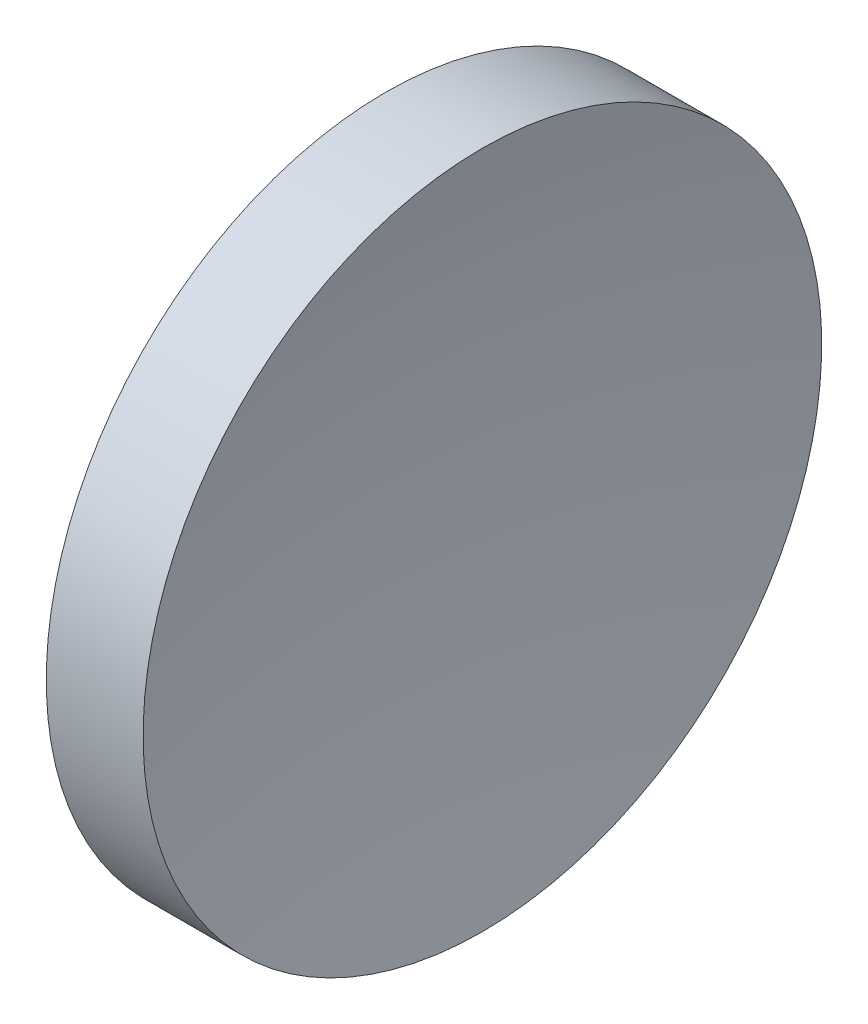
ISO-10303-21;
HEADER;
FILE_DESCRIPTION(('STEP AP214'),'2;1');
FILE_NAME('part.step','',(''),(''),'','','');
FILE_SCHEMA(('AUTOMOTIVE_DESIGN { 1 0 10303 214 1 1 1 1 }'));
ENDSEC;
DATA;
#1=APPLICATION_CONTEXT('core data for automotive mechanical design processes');
#2=APPLICATION_PROTOCOL_DEFINITION('international standard','automotive_design',2000,#1);
#3=PRODUCT_CONTEXT('',#1,'mechanical');
#4=PRODUCT('Part','Part','',(#3));
#5=PRODUCT_RELATED_PRODUCT_CATEGORY('part','',(#4));
#6=PRODUCT_DEFINITION_FORMATION('','',#4);
#7=PRODUCT_DEFINITION_CONTEXT('part definition',#1,'design');
#8=PRODUCT_DEFINITION('design','',#6,#7);
#9=PRODUCT_DEFINITION_SHAPE('','',#8);
#10=(LENGTH_UNIT() NAMED_UNIT(*) SI_UNIT(.MILLI.,.METRE.));
#11=(NAMED_UNIT(*) PLANE_ANGLE_UNIT() SI_UNIT($,.RADIAN.));
#12=(NAMED_UNIT(*) SI_UNIT($,.STERADIAN.) SOLID_ANGLE_UNIT());
#13=UNCERTAINTY_MEASURE_WITH_UNIT(LENGTH_MEASURE(1.E-05),#10,'distance_accuracy_value','');
#14=(GEOMETRIC_REPRESENTATION_CONTEXT(3) GLOBAL_UNCERTAINTY_ASSIGNED_CONTEXT((#13)) GLOBAL_UNIT_ASSIGNED_CONTEXT((#10,
#11,#12)) REPRESENTATION_CONTEXT('',''));
#15=CARTESIAN_POINT('',(0.,0.,0.));
#16=DIRECTION('',(0.,0.,1.));
#17=DIRECTION('',(1.,0.,0.));
#18=AXIS2_PLACEMENT_3D('',#15,#16,#17);
#19=CARTESIAN_POINT('',(87.6544224681736,26.0657640991432,0.));
#20=DIRECTION('',(0.,0.,-1.));
#21=DIRECTION('',(0.,-1.,0.));
#22=AXIS2_PLACEMENT_3D('',#19,#20,#21);
#23=CIRCLE('',#22,41.3);
#24=TRIMMED_CURVE('',#23,(PARAMETER_VALUE(-1.57071129250092)),
(PARAMETER_VALUE(1.57071129250092)),.T.,.PARAMETER.);
#25=CARTESIAN_POINT('',(87.6544224681736,26.0622521828061,0.));
#26=DIRECTION('',(-1.,0.,0.));
#27=AXIS1_PLACEMENT('',#25,#26);
#28=SURFACE_OF_REVOLUTION('',#24,#27);
#29=CARTESIAN_POINT('',(47.1373421562231,26.0622521828061,0.));
#30=DIRECTION('',(-1.,0.,0.));
#31=DIRECTION('',(0.,-1.,0.));
#32=AXIS2_PLACEMENT_3D('',#29,#30,#31);
#33=CIRCLE('',#32,8.);
#34=CARTESIAN_POINT('',(47.1373421562231,18.0622521828061,0.));
#35=VERTEX_POINT('',#34);
#36=EDGE_CURVE('E11',#35,#35,#33,.T.);
#37=ORIENTED_EDGE('',*,*,#36,.F.);
#38=EDGE_LOOP('',(#37));
#39=FACE_BOUND('',#38,.T.);
#40=CARTESIAN_POINT('',(46.3544226174903,26.0622521828061,0.));
#41=VERTEX_POINT('',#40);
#42=VERTEX_LOOP('',#41);
#43=FACE_BOUND('',#42,.T.);
#44=ADVANCED_FACE('F37',(#39,#43),#28,.F.);
#45=CARTESIAN_POINT('',(43.0119502361649,26.0622521828061,0.));
#46=DIRECTION('',(-1.,0.,0.));
#47=DIRECTION('',(0.,-1.,0.));
#48=AXIS2_PLACEMENT_3D('',#45,#46,#47);
#49=CYLINDRICAL_SURFACE('',#48,8.);
#50=CARTESIAN_POINT('',(44.8544226262245,26.0622521828061,0.));
#51=DIRECTION('',(-1.,0.,0.));
#52=DIRECTION('',(0.,-1.,0.));
#53=AXIS2_PLACEMENT_3D('',#50,#51,#52);
#54=CIRCLE('',#53,8.);
#55=CARTESIAN_POINT('',(44.8544226262245,18.0622521828061,0.));
#56=VERTEX_POINT('',#55);
#57=EDGE_CURVE('E43',#56,#56,#54,.T.);
#58=ORIENTED_EDGE('',*,*,#57,.F.);
#59=EDGE_LOOP('',(#58));
#60=FACE_BOUND('',#59,.T.);
#61=ORIENTED_EDGE('',*,*,#36,.T.);
#62=EDGE_LOOP('',(#61));
#63=FACE_BOUND('',#62,.T.);
#64=ADVANCED_FACE('F47',(#60,#63),#49,.T.);
#65=CARTESIAN_POINT('',(44.8544226262245,26.0622521828061,0.));
#66=DIRECTION('',(1.,0.,0.));
#67=DIRECTION('',(0.,1.,0.));
#68=AXIS2_PLACEMENT_3D('',#65,#66,#67);
#69=PLANE('',#68);
#70=ORIENTED_EDGE('',*,*,#57,.T.);
#71=EDGE_LOOP('',(#70));
#72=FACE_BOUND('',#71,.T.);
#73=ADVANCED_FACE('F52',(#72),#69,.F.);
#74=CLOSED_SHELL('',(#44,#64,#73));
#75=MANIFOLD_SOLID_BREP('B2',#74);
#76=ADVANCED_BREP_SHAPE_REPRESENTATION('',(#18,#75),#14);
#77=SHAPE_DEFINITION_REPRESENTATION(#9,#76);
ENDSEC;
END-ISO-10303-21;
